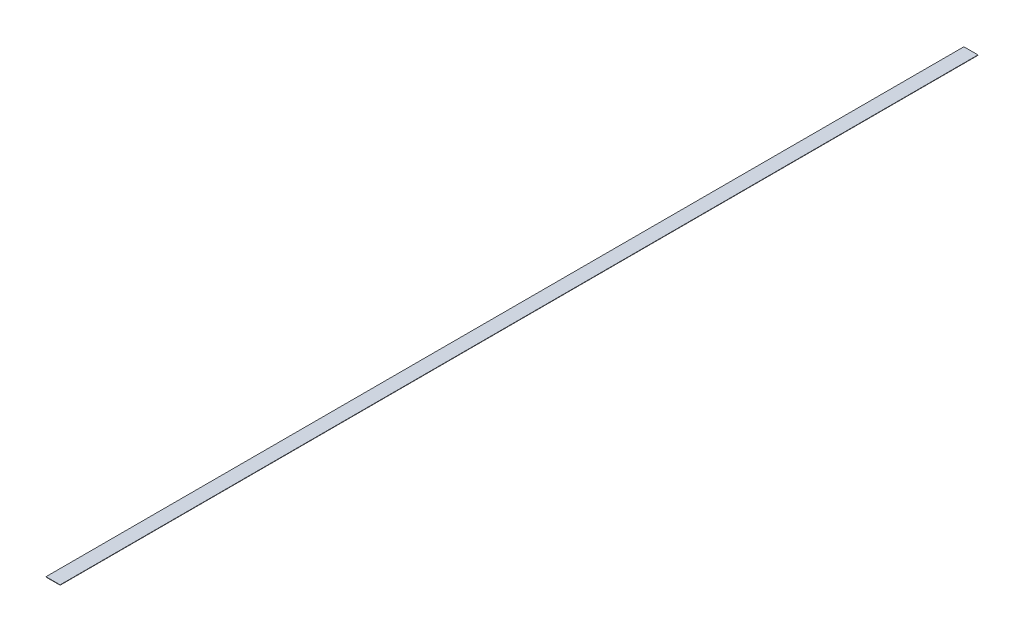
ISO-10303-21;
HEADER;
FILE_DESCRIPTION(('STEP AP214'),'2;1');
FILE_NAME('part.step','',(''),(''),'','','');
FILE_SCHEMA(('AUTOMOTIVE_DESIGN { 1 0 10303 214 1 1 1 1 }'));
ENDSEC;
DATA;
#1=APPLICATION_CONTEXT('core data for automotive mechanical design processes');
#2=APPLICATION_PROTOCOL_DEFINITION('international standard','automotive_design',2000,#1);
#3=PRODUCT_CONTEXT('',#1,'mechanical');
#4=PRODUCT('Part','Part','',(#3));
#5=PRODUCT_RELATED_PRODUCT_CATEGORY('part','',(#4));
#6=PRODUCT_DEFINITION_FORMATION('','',#4);
#7=PRODUCT_DEFINITION_CONTEXT('part definition',#1,'design');
#8=PRODUCT_DEFINITION('design','',#6,#7);
#9=PRODUCT_DEFINITION_SHAPE('','',#8);
#10=(LENGTH_UNIT() NAMED_UNIT(*) SI_UNIT(.MILLI.,.METRE.));
#11=(NAMED_UNIT(*) PLANE_ANGLE_UNIT() SI_UNIT($,.RADIAN.));
#12=(NAMED_UNIT(*) SI_UNIT($,.STERADIAN.) SOLID_ANGLE_UNIT());
#13=UNCERTAINTY_MEASURE_WITH_UNIT(LENGTH_MEASURE(1.E-05),#10,'distance_accuracy_value','');
#14=(GEOMETRIC_REPRESENTATION_CONTEXT(3) GLOBAL_UNCERTAINTY_ASSIGNED_CONTEXT((#13)) GLOBAL_UNIT_ASSIGNED_CONTEXT((#10,
#11,#12)) REPRESENTATION_CONTEXT('',''));
#15=CARTESIAN_POINT('',(0.,0.,0.));
#16=DIRECTION('',(0.,0.,1.));
#17=DIRECTION('',(1.,0.,0.));
#18=AXIS2_PLACEMENT_3D('',#15,#16,#17);
#19=CARTESIAN_POINT('',(25.4,1.27,1651.));
#20=DIRECTION('',(-1.,0.,0.));
#21=DIRECTION('',(0.,0.,1.));
#22=AXIS2_PLACEMENT_3D('',#19,#20,#21);
#23=PLANE('',#22);
#24=DIRECTION('',(0.,0.,-1.));
#25=VECTOR('',#24,1.);
#26=CARTESIAN_POINT('',(25.4,0.,1651.));
#27=LINE('',#26,#25);
#28=CARTESIAN_POINT('',(25.4,0.,1651.));
#29=VERTEX_POINT('',#28);
#30=CARTESIAN_POINT('',(25.4,0.,-1651.));
#31=VERTEX_POINT('',#30);
#32=EDGE_CURVE('E99',#29,#31,#27,.T.);
#33=ORIENTED_EDGE('',*,*,#32,.T.);
#34=DIRECTION('',(0.,-1.,0.));
#35=VECTOR('',#34,1.);
#36=CARTESIAN_POINT('',(25.4,1.27,-1651.));
#37=LINE('',#36,#35);
#38=CARTESIAN_POINT('',(25.4,1.27,-1651.));
#39=VERTEX_POINT('',#38);
#40=EDGE_CURVE('E11',#39,#31,#37,.T.);
#41=ORIENTED_EDGE('',*,*,#40,.F.);
#42=DIRECTION('',(0.,0.,-1.));
#43=VECTOR('',#42,1.);
#44=CARTESIAN_POINT('',(25.4,1.27,1651.));
#45=LINE('',#44,#43);
#46=CARTESIAN_POINT('',(25.4,1.27,1651.));
#47=VERTEX_POINT('',#46);
#48=EDGE_CURVE('E87',#47,#39,#45,.T.);
#49=ORIENTED_EDGE('',*,*,#48,.F.);
#50=DIRECTION('',(0.,-1.,0.));
#51=VECTOR('',#50,1.);
#52=CARTESIAN_POINT('',(25.4,1.27,1651.));
#53=LINE('',#52,#51);
#54=EDGE_CURVE('E95',#47,#29,#53,.T.);
#55=ORIENTED_EDGE('',*,*,#54,.T.);
#56=EDGE_LOOP('',(#33,#41,#49,#55));
#57=FACE_BOUND('',#56,.T.);
#58=ADVANCED_FACE('F36',(#57),#23,.F.);
#59=CARTESIAN_POINT('',(-25.4,1.27,-1651.));
#60=DIRECTION('',(0.,0.,1.));
#61=DIRECTION('',(1.,0.,0.));
#62=AXIS2_PLACEMENT_3D('',#59,#60,#61);
#63=PLANE('',#62);
#64=DIRECTION('',(-1.,0.,0.));
#65=VECTOR('',#64,1.);
#66=CARTESIAN_POINT('',(-25.4,0.,-1651.));
#67=LINE('',#66,#65);
#68=CARTESIAN_POINT('',(-25.4,0.,-1651.));
#69=VERTEX_POINT('',#68);
#70=EDGE_CURVE('E91',#31,#69,#67,.T.);
#71=ORIENTED_EDGE('',*,*,#70,.T.);
#72=DIRECTION('',(0.,-1.,0.));
#73=VECTOR('',#72,1.);
#74=CARTESIAN_POINT('',(-25.4,1.27,-1651.));
#75=LINE('',#74,#73);
#76=CARTESIAN_POINT('',(-25.4,1.27,-1651.));
#77=VERTEX_POINT('',#76);
#78=EDGE_CURVE('E44',#77,#69,#75,.T.);
#79=ORIENTED_EDGE('',*,*,#78,.F.);
#80=DIRECTION('',(-1.,0.,0.));
#81=VECTOR('',#80,1.);
#82=CARTESIAN_POINT('',(-25.4,1.27,-1651.));
#83=LINE('',#82,#81);
#84=EDGE_CURVE('E82',#39,#77,#83,.T.);
#85=ORIENTED_EDGE('',*,*,#84,.F.);
#86=ORIENTED_EDGE('',*,*,#40,.T.);
#87=EDGE_LOOP('',(#71,#79,#85,#86));
#88=FACE_BOUND('',#87,.T.);
#89=ADVANCED_FACE('F90',(#88),#63,.F.);
#90=CARTESIAN_POINT('',(-25.4,1.27,1651.));
#91=DIRECTION('',(1.,0.,0.));
#92=DIRECTION('',(0.,0.,-1.));
#93=AXIS2_PLACEMENT_3D('',#90,#91,#92);
#94=PLANE('',#93);
#95=DIRECTION('',(0.,0.,1.));
#96=VECTOR('',#95,1.);
#97=CARTESIAN_POINT('',(-25.4,0.,1651.));
#98=LINE('',#97,#96);
#99=CARTESIAN_POINT('',(-25.4,0.,1651.));
#100=VERTEX_POINT('',#99);
#101=EDGE_CURVE('E69',#69,#100,#98,.T.);
#102=ORIENTED_EDGE('',*,*,#101,.T.);
#103=DIRECTION('',(0.,-1.,0.));
#104=VECTOR('',#103,1.);
#105=CARTESIAN_POINT('',(-25.4,1.27,1651.));
#106=LINE('',#105,#104);
#107=CARTESIAN_POINT('',(-25.4,1.27,1651.));
#108=VERTEX_POINT('',#107);
#109=EDGE_CURVE('E92',#108,#100,#106,.T.);
#110=ORIENTED_EDGE('',*,*,#109,.F.);
#111=DIRECTION('',(0.,0.,1.));
#112=VECTOR('',#111,1.);
#113=CARTESIAN_POINT('',(-25.4,1.27,1651.));
#114=LINE('',#113,#112);
#115=EDGE_CURVE('E85',#77,#108,#114,.T.);
#116=ORIENTED_EDGE('',*,*,#115,.F.);
#117=ORIENTED_EDGE('',*,*,#78,.T.);
#118=EDGE_LOOP('',(#102,#110,#116,#117));
#119=FACE_BOUND('',#118,.T.);
#120=ADVANCED_FACE('F93',(#119),#94,.F.);
#121=CARTESIAN_POINT('',(-25.4,1.27,1651.));
#122=DIRECTION('',(0.,0.,-1.));
#123=DIRECTION('',(-1.,0.,0.));
#124=AXIS2_PLACEMENT_3D('',#121,#122,#123);
#125=PLANE('',#124);
#126=DIRECTION('',(1.,0.,0.));
#127=VECTOR('',#126,1.);
#128=CARTESIAN_POINT('',(-25.4,0.,1651.));
#129=LINE('',#128,#127);
#130=EDGE_CURVE('E75',#100,#29,#129,.T.);
#131=ORIENTED_EDGE('',*,*,#130,.T.);
#132=ORIENTED_EDGE('',*,*,#54,.F.);
#133=DIRECTION('',(1.,0.,0.));
#134=VECTOR('',#133,1.);
#135=CARTESIAN_POINT('',(-25.4,1.27,1651.));
#136=LINE('',#135,#134);
#137=EDGE_CURVE('E52',#108,#47,#136,.T.);
#138=ORIENTED_EDGE('',*,*,#137,.F.);
#139=ORIENTED_EDGE('',*,*,#109,.T.);
#140=EDGE_LOOP('',(#131,#132,#138,#139));
#141=FACE_BOUND('',#140,.T.);
#142=ADVANCED_FACE('F106',(#141),#125,.F.);
#143=CARTESIAN_POINT('',(0.,1.27,0.));
#144=DIRECTION('',(0.,-1.,0.));
#145=DIRECTION('',(0.,0.,-1.));
#146=AXIS2_PLACEMENT_3D('',#143,#144,#145);
#147=PLANE('',#146);
#148=ORIENTED_EDGE('',*,*,#48,.T.);
#149=ORIENTED_EDGE('',*,*,#84,.T.);
#150=ORIENTED_EDGE('',*,*,#115,.T.);
#151=ORIENTED_EDGE('',*,*,#137,.T.);
#152=EDGE_LOOP('',(#148,#149,#150,#151));
#153=FACE_BOUND('',#152,.T.);
#154=ADVANCED_FACE('F83',(#153),#147,.F.);
#155=CARTESIAN_POINT('',(0.,0.,0.));
#156=DIRECTION('',(0.,-1.,0.));
#157=DIRECTION('',(0.,0.,-1.));
#158=AXIS2_PLACEMENT_3D('',#155,#156,#157);
#159=PLANE('',#158);
#160=ORIENTED_EDGE('',*,*,#32,.F.);
#161=ORIENTED_EDGE('',*,*,#130,.F.);
#162=ORIENTED_EDGE('',*,*,#101,.F.);
#163=ORIENTED_EDGE('',*,*,#70,.F.);
#164=EDGE_LOOP('',(#160,#161,#162,#163));
#165=FACE_BOUND('',#164,.T.);
#166=ADVANCED_FACE('F109',(#165),#159,.T.);
#167=CLOSED_SHELL('',(#58,#89,#120,#142,#154,#166));
#168=MANIFOLD_SOLID_BREP('B2',#167);
#169=ADVANCED_BREP_SHAPE_REPRESENTATION('',(#18,#168),#14);
#170=SHAPE_DEFINITION_REPRESENTATION(#9,#169);
ENDSEC;
END-ISO-10303-21;
